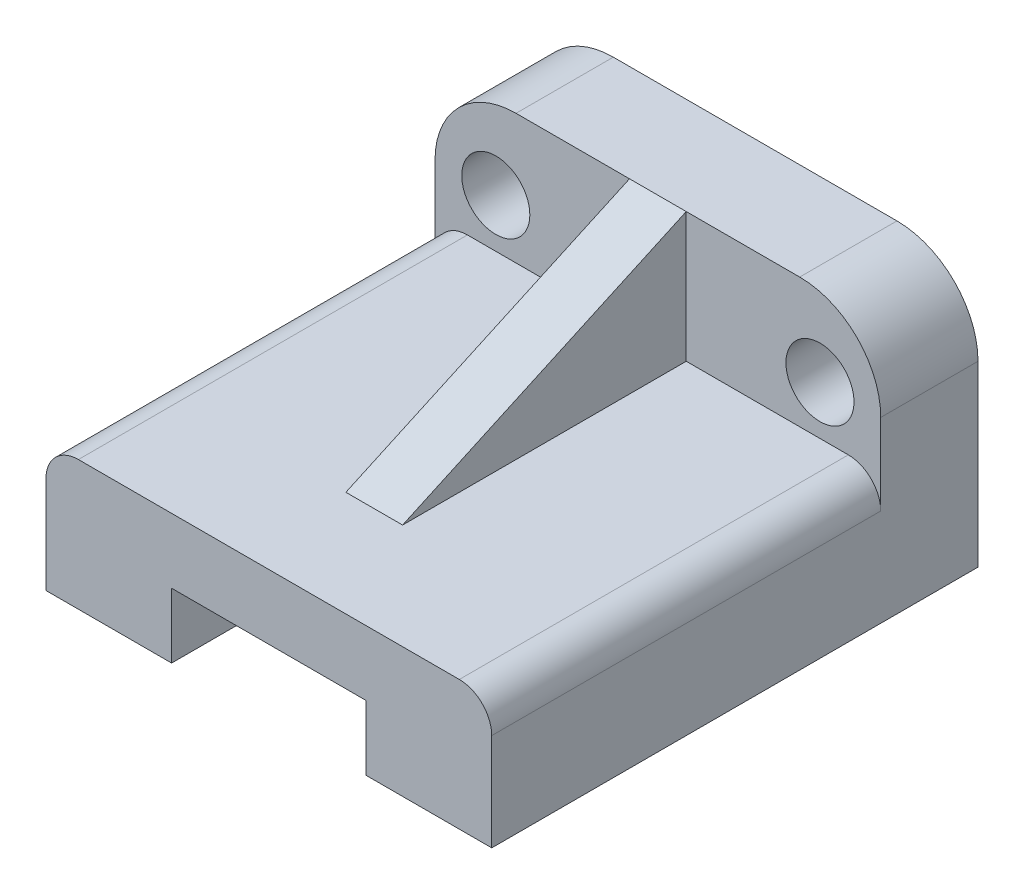
ISO-10303-21;
HEADER;
FILE_DESCRIPTION(('STEP AP214'),'2;1');
FILE_NAME('part.step','',(''),(''),'','','');
FILE_SCHEMA(('AUTOMOTIVE_DESIGN { 1 0 10303 214 1 1 1 1 }'));
ENDSEC;
DATA;
#1=APPLICATION_CONTEXT('core data for automotive mechanical design processes');
#2=APPLICATION_PROTOCOL_DEFINITION('international standard','automotive_design',2000,#1);
#3=PRODUCT_CONTEXT('',#1,'mechanical');
#4=PRODUCT('Part','Part','',(#3));
#5=PRODUCT_RELATED_PRODUCT_CATEGORY('part','',(#4));
#6=PRODUCT_DEFINITION_FORMATION('','',#4);
#7=PRODUCT_DEFINITION_CONTEXT('part definition',#1,'design');
#8=PRODUCT_DEFINITION('design','',#6,#7);
#9=PRODUCT_DEFINITION_SHAPE('','',#8);
#10=(LENGTH_UNIT() NAMED_UNIT(*) SI_UNIT(.MILLI.,.METRE.));
#11=(NAMED_UNIT(*) PLANE_ANGLE_UNIT() SI_UNIT($,.RADIAN.));
#12=(NAMED_UNIT(*) SI_UNIT($,.STERADIAN.) SOLID_ANGLE_UNIT());
#13=UNCERTAINTY_MEASURE_WITH_UNIT(LENGTH_MEASURE(1.E-05),#10,'distance_accuracy_value','');
#14=(GEOMETRIC_REPRESENTATION_CONTEXT(3) GLOBAL_UNCERTAINTY_ASSIGNED_CONTEXT((#13)) GLOBAL_UNIT_ASSIGNED_CONTEXT((#10,
#11,#12)) REPRESENTATION_CONTEXT('',''));
#15=CARTESIAN_POINT('',(0.,0.,0.));
#16=DIRECTION('',(0.,0.,1.));
#17=DIRECTION('',(1.,0.,0.));
#18=AXIS2_PLACEMENT_3D('',#15,#16,#17);
#19=CARTESIAN_POINT('',(-17.5,6.,12.));
#20=DIRECTION('',(0.,0.,1.));
#21=DIRECTION('',(1.,0.,0.));
#22=AXIS2_PLACEMENT_3D('',#19,#20,#21);
#23=PLANE('',#22);
#24=CARTESIAN_POINT('',(20.,6.,12.));
#25=DIRECTION('',(0.,0.,1.));
#26=DIRECTION('',(-1.,0.,0.));
#27=AXIS2_PLACEMENT_3D('',#24,#25,#26);
#28=CIRCLE('',#27,4.2);
#29=CARTESIAN_POINT('',(15.8,6.,12.));
#30=VERTEX_POINT('',#29);
#31=EDGE_CURVE('E283',#30,#30,#28,.T.);
#32=ORIENTED_EDGE('',*,*,#31,.F.);
#33=EDGE_LOOP('',(#32));
#34=FACE_BOUND('',#33,.T.);
#35=DIRECTION('',(-1.,0.,0.));
#36=VECTOR('',#35,1.);
#37=CARTESIAN_POINT('',(-17.4999999999999,16.,12.));
#38=LINE('',#37,#36);
#39=CARTESIAN_POINT('',(17.4999999999999,16.,12.));
#40=VERTEX_POINT('',#39);
#41=CARTESIAN_POINT('',(3.5,16.,12.));
#42=VERTEX_POINT('',#41);
#43=EDGE_CURVE('E178',#40,#42,#38,.T.);
#44=ORIENTED_EDGE('',*,*,#43,.T.);
#45=DIRECTION('',(0.,1.,0.));
#46=VECTOR('',#45,1.);
#47=CARTESIAN_POINT('',(3.5,0.,12.));
#48=LINE('',#47,#46);
#49=CARTESIAN_POINT('',(3.5,0.,12.));
#50=VERTEX_POINT('',#49);
#51=EDGE_CURVE('E164',#50,#42,#48,.T.);
#52=ORIENTED_EDGE('',*,*,#51,.F.);
#53=DIRECTION('',(-1.,0.,0.));
#54=VECTOR('',#53,1.);
#55=CARTESIAN_POINT('',(-23.5,0.,12.));
#56=LINE('',#55,#54);
#57=CARTESIAN_POINT('',(23.5,0.,12.));
#58=VERTEX_POINT('',#57);
#59=EDGE_CURVE('E253',#58,#50,#56,.T.);
#60=ORIENTED_EDGE('',*,*,#59,.F.);
#61=CARTESIAN_POINT('',(23.5,-4.,12.));
#62=DIRECTION('',(0.,0.,1.));
#63=DIRECTION('',(-1.,0.,0.));
#64=AXIS2_PLACEMENT_3D('',#61,#62,#63);
#65=CIRCLE('',#64,4.);
#66=CARTESIAN_POINT('',(27.5,-4.,12.));
#67=VERTEX_POINT('',#66);
#68=EDGE_CURVE('E294',#67,#58,#65,.T.);
#69=ORIENTED_EDGE('',*,*,#68,.F.);
#70=DIRECTION('',(0.,1.,0.));
#71=VECTOR('',#70,1.);
#72=CARTESIAN_POINT('',(27.5,5.99999999999993,12.));
#73=LINE('',#72,#71);
#74=CARTESIAN_POINT('',(27.5,5.99999999999993,12.));
#75=VERTEX_POINT('',#74);
#76=EDGE_CURVE('E211',#67,#75,#73,.T.);
#77=ORIENTED_EDGE('',*,*,#76,.T.);
#78=CARTESIAN_POINT('',(17.5,6.,12.));
#79=DIRECTION('',(0.,0.,1.));
#80=DIRECTION('',(-1.,0.,0.));
#81=AXIS2_PLACEMENT_3D('',#78,#79,#80);
#82=CIRCLE('',#81,10.);
#83=EDGE_CURVE('E184',#75,#40,#82,.T.);
#84=ORIENTED_EDGE('',*,*,#83,.T.);
#85=EDGE_LOOP('',(#44,#52,#60,#69,#77,#84));
#86=FACE_BOUND('',#85,.T.);
#87=ADVANCED_FACE('F33',(#34,#86),#23,.T.);
#88=CARTESIAN_POINT('',(-23.5,0.,60.));
#89=DIRECTION('',(0.,-1.,0.));
#90=DIRECTION('',(0.,0.,-1.));
#91=AXIS2_PLACEMENT_3D('',#88,#89,#90);
#92=PLANE('',#91);
#93=DIRECTION('',(0.,0.,-1.));
#94=VECTOR('',#93,1.);
#95=CARTESIAN_POINT('',(3.5,0.,47.));
#96=LINE('',#95,#94);
#97=CARTESIAN_POINT('',(3.5,0.,47.));
#98=VERTEX_POINT('',#97);
#99=EDGE_CURVE('E163',#98,#50,#96,.T.);
#100=ORIENTED_EDGE('',*,*,#99,.F.);
#101=DIRECTION('',(-1.,0.,0.));
#102=VECTOR('',#101,1.);
#103=CARTESIAN_POINT('',(3.5,0.,47.));
#104=LINE('',#103,#102);
#105=CARTESIAN_POINT('',(-3.5,0.,47.));
#106=VERTEX_POINT('',#105);
#107=EDGE_CURVE('E160',#98,#106,#104,.T.);
#108=ORIENTED_EDGE('',*,*,#107,.T.);
#109=DIRECTION('',(0.,0.,-1.));
#110=VECTOR('',#109,1.);
#111=CARTESIAN_POINT('',(-3.5,0.,47.));
#112=LINE('',#111,#110);
#113=CARTESIAN_POINT('',(-3.5,0.,12.));
#114=VERTEX_POINT('',#113);
#115=EDGE_CURVE('E171',#106,#114,#112,.T.);
#116=ORIENTED_EDGE('',*,*,#115,.T.);
#117=CARTESIAN_POINT('',(-23.5,0.,12.));
#118=VERTEX_POINT('',#117);
#119=EDGE_CURVE('E55',#114,#118,#56,.T.);
#120=ORIENTED_EDGE('',*,*,#119,.T.);
#121=DIRECTION('',(0.,0.,-1.));
#122=VECTOR('',#121,1.);
#123=CARTESIAN_POINT('',(-23.5,0.,60.));
#124=LINE('',#123,#122);
#125=CARTESIAN_POINT('',(-23.5,0.,60.));
#126=VERTEX_POINT('',#125);
#127=EDGE_CURVE('E251',#126,#118,#124,.T.);
#128=ORIENTED_EDGE('',*,*,#127,.F.);
#129=DIRECTION('',(-1.,0.,0.));
#130=VECTOR('',#129,1.);
#131=CARTESIAN_POINT('',(-23.5,0.,60.));
#132=LINE('',#131,#130);
#133=CARTESIAN_POINT('',(23.5,0.,60.));
#134=VERTEX_POINT('',#133);
#135=EDGE_CURVE('E309',#134,#126,#132,.T.);
#136=ORIENTED_EDGE('',*,*,#135,.F.);
#137=DIRECTION('',(0.,0.,-1.));
#138=VECTOR('',#137,1.);
#139=CARTESIAN_POINT('',(23.5,0.,60.));
#140=LINE('',#139,#138);
#141=EDGE_CURVE('E264',#134,#58,#140,.T.);
#142=ORIENTED_EDGE('',*,*,#141,.T.);
#143=ORIENTED_EDGE('',*,*,#59,.T.);
#144=EDGE_LOOP('',(#100,#108,#116,#120,#128,#136,#142,#143));
#145=FACE_BOUND('',#144,.T.);
#146=ADVANCED_FACE('F326',(#145),#92,.F.);
#147=DIRECTION('',(0.,1.,0.));
#148=VECTOR('',#147,1.);
#149=CARTESIAN_POINT('',(-3.5,0.,12.));
#150=LINE('',#149,#148);
#151=CARTESIAN_POINT('',(-3.5,16.,12.));
#152=VERTEX_POINT('',#151);
#153=EDGE_CURVE('E48',#114,#152,#150,.T.);
#154=ORIENTED_EDGE('',*,*,#153,.T.);
#155=CARTESIAN_POINT('',(-17.4999999999999,16.,12.));
#156=VERTEX_POINT('',#155);
#157=EDGE_CURVE('E180',#152,#156,#38,.T.);
#158=ORIENTED_EDGE('',*,*,#157,.T.);
#159=CARTESIAN_POINT('',(-17.5,6.,12.));
#160=DIRECTION('',(0.,0.,1.));
#161=DIRECTION('',(1.,0.,0.));
#162=AXIS2_PLACEMENT_3D('',#159,#160,#161);
#163=CIRCLE('',#162,10.);
#164=CARTESIAN_POINT('',(-27.5,5.99999999999993,12.));
#165=VERTEX_POINT('',#164);
#166=EDGE_CURVE('E186',#156,#165,#163,.T.);
#167=ORIENTED_EDGE('',*,*,#166,.T.);
#168=DIRECTION('',(0.,-1.,0.));
#169=VECTOR('',#168,1.);
#170=CARTESIAN_POINT('',(-27.5,5.99999999999993,12.));
#171=LINE('',#170,#169);
#172=CARTESIAN_POINT('',(-27.5,-4.,12.));
#173=VERTEX_POINT('',#172);
#174=EDGE_CURVE('E188',#165,#173,#171,.T.);
#175=ORIENTED_EDGE('',*,*,#174,.T.);
#176=CARTESIAN_POINT('',(-23.5,-4.,12.));
#177=DIRECTION('',(0.,0.,1.));
#178=DIRECTION('',(-1.,0.,0.));
#179=AXIS2_PLACEMENT_3D('',#176,#177,#178);
#180=CIRCLE('',#179,4.);
#181=EDGE_CURVE('E246',#118,#173,#180,.T.);
#182=ORIENTED_EDGE('',*,*,#181,.F.);
#183=ORIENTED_EDGE('',*,*,#119,.F.);
#184=EDGE_LOOP('',(#154,#158,#167,#175,#182,#183));
#185=FACE_BOUND('',#184,.T.);
#186=CARTESIAN_POINT('',(-20.,6.,12.));
#187=DIRECTION('',(0.,0.,1.));
#188=DIRECTION('',(1.,0.,0.));
#189=AXIS2_PLACEMENT_3D('',#186,#187,#188);
#190=CIRCLE('',#189,4.2);
#191=CARTESIAN_POINT('',(-15.8,6.,12.));
#192=VERTEX_POINT('',#191);
#193=EDGE_CURVE('E201',#192,#192,#190,.T.);
#194=ORIENTED_EDGE('',*,*,#193,.F.);
#195=EDGE_LOOP('',(#194));
#196=FACE_BOUND('',#195,.T.);
#197=ADVANCED_FACE('F244',(#185,#196),#23,.T.);
#198=DIRECTION('',(0.,-1.,0.));
#199=VECTOR('',#198,1.);
#200=CARTESIAN_POINT('',(12.,-16.,12.));
#201=LINE('',#200,#199);
#202=CARTESIAN_POINT('',(12.,-8.,12.));
#203=VERTEX_POINT('',#202);
#204=CARTESIAN_POINT('',(12.,-16.,12.));
#205=VERTEX_POINT('',#204);
#206=EDGE_CURVE('E320',#203,#205,#201,.T.);
#207=ORIENTED_EDGE('',*,*,#206,.F.);
#208=DIRECTION('',(1.,0.,0.));
#209=VECTOR('',#208,1.);
#210=CARTESIAN_POINT('',(-12.,-8.,12.));
#211=LINE('',#210,#209);
#212=CARTESIAN_POINT('',(-12.,-8.,12.));
#213=VERTEX_POINT('',#212);
#214=EDGE_CURVE('E317',#213,#203,#211,.T.);
#215=ORIENTED_EDGE('',*,*,#214,.F.);
#216=DIRECTION('',(0.,1.,0.));
#217=VECTOR('',#216,1.);
#218=CARTESIAN_POINT('',(-12.,-16.,12.));
#219=LINE('',#218,#217);
#220=CARTESIAN_POINT('',(-12.,-16.,12.));
#221=VERTEX_POINT('',#220);
#222=EDGE_CURVE('E181',#221,#213,#219,.T.);
#223=ORIENTED_EDGE('',*,*,#222,.F.);
#224=DIRECTION('',(1.,0.,0.));
#225=VECTOR('',#224,1.);
#226=CARTESIAN_POINT('',(-27.5,-16.,12.));
#227=LINE('',#226,#225);
#228=EDGE_CURVE('E194',#221,#205,#227,.T.);
#229=ORIENTED_EDGE('',*,*,#228,.T.);
#230=EDGE_LOOP('',(#207,#215,#223,#229));
#231=FACE_BOUND('',#230,.T.);
#232=ADVANCED_FACE('F351',(#231),#23,.T.);
#233=CARTESIAN_POINT('',(-17.5,6.,0.));
#234=DIRECTION('',(0.,0.,1.));
#235=DIRECTION('',(1.,0.,0.));
#236=AXIS2_PLACEMENT_3D('',#233,#234,#235);
#237=PLANE('',#236);
#238=DIRECTION('',(0.,1.,0.));
#239=VECTOR('',#238,1.);
#240=CARTESIAN_POINT('',(27.5,5.99999999999993,0.));
#241=LINE('',#240,#239);
#242=CARTESIAN_POINT('',(27.5,-16.,0.));
#243=VERTEX_POINT('',#242);
#244=CARTESIAN_POINT('',(27.5,5.99999999999993,0.));
#245=VERTEX_POINT('',#244);
#246=EDGE_CURVE('E197',#243,#245,#241,.T.);
#247=ORIENTED_EDGE('',*,*,#246,.F.);
#248=DIRECTION('',(1.,0.,0.));
#249=VECTOR('',#248,1.);
#250=CARTESIAN_POINT('',(-27.5,-16.,0.));
#251=LINE('',#250,#249);
#252=CARTESIAN_POINT('',(-27.5,-16.,0.));
#253=VERTEX_POINT('',#252);
#254=EDGE_CURVE('E209',#253,#243,#251,.T.);
#255=ORIENTED_EDGE('',*,*,#254,.F.);
#256=DIRECTION('',(0.,-1.,0.));
#257=VECTOR('',#256,1.);
#258=CARTESIAN_POINT('',(-27.5,5.99999999999993,0.));
#259=LINE('',#258,#257);
#260=CARTESIAN_POINT('',(-27.5,5.99999999999993,0.));
#261=VERTEX_POINT('',#260);
#262=EDGE_CURVE('E207',#261,#253,#259,.T.);
#263=ORIENTED_EDGE('',*,*,#262,.F.);
#264=CARTESIAN_POINT('',(-17.5,6.,0.));
#265=DIRECTION('',(0.,0.,1.));
#266=DIRECTION('',(1.,0.,0.));
#267=AXIS2_PLACEMENT_3D('',#264,#265,#266);
#268=CIRCLE('',#267,10.);
#269=CARTESIAN_POINT('',(-17.4999999999999,16.,0.));
#270=VERTEX_POINT('',#269);
#271=EDGE_CURVE('E205',#270,#261,#268,.T.);
#272=ORIENTED_EDGE('',*,*,#271,.F.);
#273=DIRECTION('',(-1.,0.,0.));
#274=VECTOR('',#273,1.);
#275=CARTESIAN_POINT('',(-17.4999999999999,16.,0.));
#276=LINE('',#275,#274);
#277=CARTESIAN_POINT('',(17.4999999999999,16.,0.));
#278=VERTEX_POINT('',#277);
#279=EDGE_CURVE('E203',#278,#270,#276,.T.);
#280=ORIENTED_EDGE('',*,*,#279,.F.);
#281=CARTESIAN_POINT('',(17.5,6.,0.));
#282=DIRECTION('',(0.,0.,1.));
#283=DIRECTION('',(-1.,0.,0.));
#284=AXIS2_PLACEMENT_3D('',#281,#282,#283);
#285=CIRCLE('',#284,10.);
#286=EDGE_CURVE('E200',#245,#278,#285,.T.);
#287=ORIENTED_EDGE('',*,*,#286,.F.);
#288=EDGE_LOOP('',(#247,#255,#263,#272,#280,#287));
#289=FACE_BOUND('',#288,.T.);
#290=CARTESIAN_POINT('',(-20.,6.,0.));
#291=DIRECTION('',(0.,0.,1.));
#292=DIRECTION('',(1.,0.,0.));
#293=AXIS2_PLACEMENT_3D('',#290,#291,#292);
#294=CIRCLE('',#293,4.2);
#295=CARTESIAN_POINT('',(-15.8,6.,0.));
#296=VERTEX_POINT('',#295);
#297=EDGE_CURVE('E286',#296,#296,#294,.T.);
#298=ORIENTED_EDGE('',*,*,#297,.T.);
#299=EDGE_LOOP('',(#298));
#300=FACE_BOUND('',#299,.T.);
#301=CARTESIAN_POINT('',(20.,6.,0.));
#302=DIRECTION('',(0.,0.,1.));
#303=DIRECTION('',(-1.,0.,0.));
#304=AXIS2_PLACEMENT_3D('',#301,#302,#303);
#305=CIRCLE('',#304,4.2);
#306=CARTESIAN_POINT('',(15.8,6.,0.));
#307=VERTEX_POINT('',#306);
#308=EDGE_CURVE('E282',#307,#307,#305,.T.);
#309=ORIENTED_EDGE('',*,*,#308,.T.);
#310=EDGE_LOOP('',(#309));
#311=FACE_BOUND('',#310,.T.);
#312=ADVANCED_FACE('F227',(#289,#300,#311),#237,.F.);
#313=CARTESIAN_POINT('',(27.5,5.99999999999993,12.));
#314=DIRECTION('',(-1.,0.,0.));
#315=DIRECTION('',(0.,0.,1.));
#316=AXIS2_PLACEMENT_3D('',#313,#314,#315);
#317=PLANE('',#316);
#318=ORIENTED_EDGE('',*,*,#246,.T.);
#319=DIRECTION('',(0.,0.,-1.));
#320=VECTOR('',#319,1.);
#321=CARTESIAN_POINT('',(27.5,5.99999999999993,12.));
#322=LINE('',#321,#320);
#323=EDGE_CURVE('E11',#75,#245,#322,.T.);
#324=ORIENTED_EDGE('',*,*,#323,.F.);
#325=ORIENTED_EDGE('',*,*,#76,.F.);
#326=DIRECTION('',(0.,0.,-1.));
#327=VECTOR('',#326,1.);
#328=CARTESIAN_POINT('',(27.5,-4.00000000000003,60.));
#329=LINE('',#328,#327);
#330=CARTESIAN_POINT('',(27.5,-4.00000000000003,60.));
#331=VERTEX_POINT('',#330);
#332=EDGE_CURVE('E267',#331,#67,#329,.T.);
#333=ORIENTED_EDGE('',*,*,#332,.F.);
#334=DIRECTION('',(0.,1.,0.));
#335=VECTOR('',#334,1.);
#336=CARTESIAN_POINT('',(27.5,-16.,60.));
#337=LINE('',#336,#335);
#338=CARTESIAN_POINT('',(27.5,-16.,60.));
#339=VERTEX_POINT('',#338);
#340=EDGE_CURVE('E343',#339,#331,#337,.T.);
#341=ORIENTED_EDGE('',*,*,#340,.F.);
#342=DIRECTION('',(0.,0.,-1.));
#343=VECTOR('',#342,1.);
#344=CARTESIAN_POINT('',(27.5,-16.,12.));
#345=LINE('',#344,#343);
#346=EDGE_CURVE('E196',#339,#243,#345,.T.);
#347=ORIENTED_EDGE('',*,*,#346,.T.);
#348=EDGE_LOOP('',(#318,#324,#325,#333,#341,#347));
#349=FACE_BOUND('',#348,.T.);
#350=ADVANCED_FACE('F35',(#349),#317,.F.);
#351=CARTESIAN_POINT('',(17.5,6.,12.));
#352=DIRECTION('',(0.,0.,-1.));
#353=DIRECTION('',(-1.,0.,0.));
#354=AXIS2_PLACEMENT_3D('',#351,#352,#353);
#355=CYLINDRICAL_SURFACE('',#354,10.);
#356=ORIENTED_EDGE('',*,*,#286,.T.);
#357=DIRECTION('',(0.,0.,-1.));
#358=VECTOR('',#357,1.);
#359=CARTESIAN_POINT('',(17.4999999999999,16.,12.));
#360=LINE('',#359,#358);
#361=EDGE_CURVE('E41',#40,#278,#360,.T.);
#362=ORIENTED_EDGE('',*,*,#361,.F.);
#363=ORIENTED_EDGE('',*,*,#83,.F.);
#364=ORIENTED_EDGE('',*,*,#323,.T.);
#365=EDGE_LOOP('',(#356,#362,#363,#364));
#366=FACE_BOUND('',#365,.T.);
#367=ADVANCED_FACE('F298',(#366),#355,.T.);
#368=CARTESIAN_POINT('',(-17.4999999999999,16.,12.));
#369=DIRECTION('',(0.,-1.,0.));
#370=DIRECTION('',(0.,0.,-1.));
#371=AXIS2_PLACEMENT_3D('',#368,#369,#370);
#372=PLANE('',#371);
#373=ORIENTED_EDGE('',*,*,#279,.T.);
#374=DIRECTION('',(0.,0.,-1.));
#375=VECTOR('',#374,1.);
#376=CARTESIAN_POINT('',(-17.4999999999999,16.,12.));
#377=LINE('',#376,#375);
#378=EDGE_CURVE('E220',#156,#270,#377,.T.);
#379=ORIENTED_EDGE('',*,*,#378,.F.);
#380=ORIENTED_EDGE('',*,*,#157,.F.);
#381=DIRECTION('',(-1.,0.,0.));
#382=VECTOR('',#381,1.);
#383=CARTESIAN_POINT('',(3.5,16.,12.));
#384=LINE('',#383,#382);
#385=EDGE_CURVE('E158',#42,#152,#384,.T.);
#386=ORIENTED_EDGE('',*,*,#385,.F.);
#387=ORIENTED_EDGE('',*,*,#43,.F.);
#388=ORIENTED_EDGE('',*,*,#361,.T.);
#389=EDGE_LOOP('',(#373,#379,#380,#386,#387,#388));
#390=FACE_BOUND('',#389,.T.);
#391=ADVANCED_FACE('F176',(#390),#372,.F.);
#392=CARTESIAN_POINT('',(-17.5,6.,12.));
#393=DIRECTION('',(0.,0.,-1.));
#394=DIRECTION('',(-1.,0.,0.));
#395=AXIS2_PLACEMENT_3D('',#392,#393,#394);
#396=CYLINDRICAL_SURFACE('',#395,10.);
#397=ORIENTED_EDGE('',*,*,#271,.T.);
#398=DIRECTION('',(0.,0.,-1.));
#399=VECTOR('',#398,1.);
#400=CARTESIAN_POINT('',(-27.5,5.99999999999993,12.));
#401=LINE('',#400,#399);
#402=EDGE_CURVE('E217',#165,#261,#401,.T.);
#403=ORIENTED_EDGE('',*,*,#402,.F.);
#404=ORIENTED_EDGE('',*,*,#166,.F.);
#405=ORIENTED_EDGE('',*,*,#378,.T.);
#406=EDGE_LOOP('',(#397,#403,#404,#405));
#407=FACE_BOUND('',#406,.T.);
#408=ADVANCED_FACE('F233',(#407),#396,.T.);
#409=CARTESIAN_POINT('',(-27.5,5.99999999999993,12.));
#410=DIRECTION('',(1.,0.,0.));
#411=DIRECTION('',(0.,1.,0.));
#412=AXIS2_PLACEMENT_3D('',#409,#410,#411);
#413=PLANE('',#412);
#414=ORIENTED_EDGE('',*,*,#262,.T.);
#415=DIRECTION('',(0.,0.,-1.));
#416=VECTOR('',#415,1.);
#417=CARTESIAN_POINT('',(-27.5,-16.,12.));
#418=LINE('',#417,#416);
#419=CARTESIAN_POINT('',(-27.5,-16.,60.));
#420=VERTEX_POINT('',#419);
#421=EDGE_CURVE('E214',#420,#253,#418,.T.);
#422=ORIENTED_EDGE('',*,*,#421,.F.);
#423=DIRECTION('',(0.,-1.,0.));
#424=VECTOR('',#423,1.);
#425=CARTESIAN_POINT('',(-27.5,-16.,60.));
#426=LINE('',#425,#424);
#427=CARTESIAN_POINT('',(-27.5,-4.00000000000003,60.));
#428=VERTEX_POINT('',#427);
#429=EDGE_CURVE('E252',#428,#420,#426,.T.);
#430=ORIENTED_EDGE('',*,*,#429,.F.);
#431=DIRECTION('',(0.,0.,-1.));
#432=VECTOR('',#431,1.);
#433=CARTESIAN_POINT('',(-27.5,-4.00000000000003,60.));
#434=LINE('',#433,#432);
#435=EDGE_CURVE('E241',#428,#173,#434,.T.);
#436=ORIENTED_EDGE('',*,*,#435,.T.);
#437=ORIENTED_EDGE('',*,*,#174,.F.);
#438=ORIENTED_EDGE('',*,*,#402,.T.);
#439=EDGE_LOOP('',(#414,#422,#430,#436,#437,#438));
#440=FACE_BOUND('',#439,.T.);
#441=ADVANCED_FACE('F237',(#440),#413,.F.);
#442=CARTESIAN_POINT('',(-27.5,-16.,12.));
#443=DIRECTION('',(0.,1.,0.));
#444=DIRECTION('',(0.,0.,1.));
#445=AXIS2_PLACEMENT_3D('',#442,#443,#444);
#446=PLANE('',#445);
#447=ORIENTED_EDGE('',*,*,#254,.T.);
#448=ORIENTED_EDGE('',*,*,#346,.F.);
#449=DIRECTION('',(1.,0.,0.));
#450=VECTOR('',#449,1.);
#451=CARTESIAN_POINT('',(12.,-16.,60.));
#452=LINE('',#451,#450);
#453=CARTESIAN_POINT('',(12.,-16.,60.));
#454=VERTEX_POINT('',#453);
#455=EDGE_CURVE('E341',#454,#339,#452,.T.);
#456=ORIENTED_EDGE('',*,*,#455,.F.);
#457=DIRECTION('',(0.,0.,-1.));
#458=VECTOR('',#457,1.);
#459=CARTESIAN_POINT('',(12.,-16.,60.));
#460=LINE('',#459,#458);
#461=EDGE_CURVE('E270',#454,#205,#460,.T.);
#462=ORIENTED_EDGE('',*,*,#461,.T.);
#463=ORIENTED_EDGE('',*,*,#228,.F.);
#464=DIRECTION('',(0.,0.,-1.));
#465=VECTOR('',#464,1.);
#466=CARTESIAN_POINT('',(-12.,-16.,60.));
#467=LINE('',#466,#465);
#468=CARTESIAN_POINT('',(-12.,-16.,60.));
#469=VERTEX_POINT('',#468);
#470=EDGE_CURVE('E279',#469,#221,#467,.T.);
#471=ORIENTED_EDGE('',*,*,#470,.F.);
#472=DIRECTION('',(1.,0.,0.));
#473=VECTOR('',#472,1.);
#474=CARTESIAN_POINT('',(-27.5,-16.,60.));
#475=LINE('',#474,#473);
#476=EDGE_CURVE('E256',#420,#469,#475,.T.);
#477=ORIENTED_EDGE('',*,*,#476,.F.);
#478=ORIENTED_EDGE('',*,*,#421,.T.);
#479=EDGE_LOOP('',(#447,#448,#456,#462,#463,#471,#477,#478));
#480=FACE_BOUND('',#479,.T.);
#481=ADVANCED_FACE('F301',(#480),#446,.F.);
#482=CARTESIAN_POINT('',(-20.,6.,12.));
#483=DIRECTION('',(0.,0.,-1.));
#484=DIRECTION('',(-1.,0.,0.));
#485=AXIS2_PLACEMENT_3D('',#482,#483,#484);
#486=CYLINDRICAL_SURFACE('',#485,4.2);
#487=ORIENTED_EDGE('',*,*,#193,.T.);
#488=EDGE_LOOP('',(#487));
#489=FACE_BOUND('',#488,.T.);
#490=ORIENTED_EDGE('',*,*,#297,.F.);
#491=EDGE_LOOP('',(#490));
#492=FACE_BOUND('',#491,.T.);
#493=ADVANCED_FACE('F367',(#489,#492),#486,.F.);
#494=CARTESIAN_POINT('',(20.,6.,12.));
#495=DIRECTION('',(0.,0.,-1.));
#496=DIRECTION('',(-1.,0.,0.));
#497=AXIS2_PLACEMENT_3D('',#494,#495,#496);
#498=CYLINDRICAL_SURFACE('',#497,4.2);
#499=ORIENTED_EDGE('',*,*,#31,.T.);
#500=EDGE_LOOP('',(#499));
#501=FACE_BOUND('',#500,.T.);
#502=ORIENTED_EDGE('',*,*,#308,.F.);
#503=EDGE_LOOP('',(#502));
#504=FACE_BOUND('',#503,.T.);
#505=ADVANCED_FACE('F360',(#501,#504),#498,.F.);
#506=CARTESIAN_POINT('',(-12.,-16.,60.));
#507=DIRECTION('',(-1.,0.,0.));
#508=DIRECTION('',(0.,-1.,0.));
#509=AXIS2_PLACEMENT_3D('',#506,#507,#508);
#510=PLANE('',#509);
#511=ORIENTED_EDGE('',*,*,#222,.T.);
#512=DIRECTION('',(0.,0.,-1.));
#513=VECTOR('',#512,1.);
#514=CARTESIAN_POINT('',(-12.,-8.,60.));
#515=LINE('',#514,#513);
#516=CARTESIAN_POINT('',(-12.,-8.,60.));
#517=VERTEX_POINT('',#516);
#518=EDGE_CURVE('E276',#517,#213,#515,.T.);
#519=ORIENTED_EDGE('',*,*,#518,.F.);
#520=DIRECTION('',(0.,1.,0.));
#521=VECTOR('',#520,1.);
#522=CARTESIAN_POINT('',(-12.,-16.,60.));
#523=LINE('',#522,#521);
#524=EDGE_CURVE('E335',#469,#517,#523,.T.);
#525=ORIENTED_EDGE('',*,*,#524,.F.);
#526=ORIENTED_EDGE('',*,*,#470,.T.);
#527=EDGE_LOOP('',(#511,#519,#525,#526));
#528=FACE_BOUND('',#527,.T.);
#529=ADVANCED_FACE('F358',(#528),#510,.F.);
#530=CARTESIAN_POINT('',(-12.,-8.,60.));
#531=DIRECTION('',(0.,1.,0.));
#532=DIRECTION('',(0.,0.,1.));
#533=AXIS2_PLACEMENT_3D('',#530,#531,#532);
#534=PLANE('',#533);
#535=ORIENTED_EDGE('',*,*,#214,.T.);
#536=DIRECTION('',(0.,0.,-1.));
#537=VECTOR('',#536,1.);
#538=CARTESIAN_POINT('',(12.,-8.,60.));
#539=LINE('',#538,#537);
#540=CARTESIAN_POINT('',(12.,-8.,60.));
#541=VERTEX_POINT('',#540);
#542=EDGE_CURVE('E273',#541,#203,#539,.T.);
#543=ORIENTED_EDGE('',*,*,#542,.F.);
#544=DIRECTION('',(1.,0.,0.));
#545=VECTOR('',#544,1.);
#546=CARTESIAN_POINT('',(-12.,-8.,60.));
#547=LINE('',#546,#545);
#548=EDGE_CURVE('E337',#517,#541,#547,.T.);
#549=ORIENTED_EDGE('',*,*,#548,.F.);
#550=ORIENTED_EDGE('',*,*,#518,.T.);
#551=EDGE_LOOP('',(#535,#543,#549,#550));
#552=FACE_BOUND('',#551,.T.);
#553=ADVANCED_FACE('F353',(#552),#534,.F.);
#554=CARTESIAN_POINT('',(12.,-16.,60.));
#555=DIRECTION('',(1.,0.,0.));
#556=DIRECTION('',(0.,1.,0.));
#557=AXIS2_PLACEMENT_3D('',#554,#555,#556);
#558=PLANE('',#557);
#559=ORIENTED_EDGE('',*,*,#206,.T.);
#560=ORIENTED_EDGE('',*,*,#461,.F.);
#561=DIRECTION('',(0.,-1.,0.));
#562=VECTOR('',#561,1.);
#563=CARTESIAN_POINT('',(12.,-16.,60.));
#564=LINE('',#563,#562);
#565=EDGE_CURVE('E339',#541,#454,#564,.T.);
#566=ORIENTED_EDGE('',*,*,#565,.F.);
#567=ORIENTED_EDGE('',*,*,#542,.T.);
#568=EDGE_LOOP('',(#559,#560,#566,#567));
#569=FACE_BOUND('',#568,.T.);
#570=ADVANCED_FACE('F348',(#569),#558,.F.);
#571=CARTESIAN_POINT('',(23.5,-4.,60.));
#572=DIRECTION('',(0.,0.,-1.));
#573=DIRECTION('',(-1.,0.,0.));
#574=AXIS2_PLACEMENT_3D('',#571,#572,#573);
#575=CYLINDRICAL_SURFACE('',#574,4.);
#576=ORIENTED_EDGE('',*,*,#68,.T.);
#577=ORIENTED_EDGE('',*,*,#141,.F.);
#578=CARTESIAN_POINT('',(23.5,-4.,60.));
#579=DIRECTION('',(0.,0.,1.));
#580=DIRECTION('',(-1.,0.,0.));
#581=AXIS2_PLACEMENT_3D('',#578,#579,#580);
#582=CIRCLE('',#581,4.);
#583=EDGE_CURVE('E311',#331,#134,#582,.T.);
#584=ORIENTED_EDGE('',*,*,#583,.F.);
#585=ORIENTED_EDGE('',*,*,#332,.T.);
#586=EDGE_LOOP('',(#576,#577,#584,#585));
#587=FACE_BOUND('',#586,.T.);
#588=ADVANCED_FACE('F324',(#587),#575,.T.);
#589=CARTESIAN_POINT('',(-23.5,-4.,60.));
#590=DIRECTION('',(0.,0.,-1.));
#591=DIRECTION('',(-1.,0.,0.));
#592=AXIS2_PLACEMENT_3D('',#589,#590,#591);
#593=CYLINDRICAL_SURFACE('',#592,4.);
#594=ORIENTED_EDGE('',*,*,#181,.T.);
#595=ORIENTED_EDGE('',*,*,#435,.F.);
#596=CARTESIAN_POINT('',(-23.5,-4.,60.));
#597=DIRECTION('',(0.,0.,1.));
#598=DIRECTION('',(-1.,0.,0.));
#599=AXIS2_PLACEMENT_3D('',#596,#597,#598);
#600=CIRCLE('',#599,4.);
#601=EDGE_CURVE('E262',#126,#428,#600,.T.);
#602=ORIENTED_EDGE('',*,*,#601,.F.);
#603=ORIENTED_EDGE('',*,*,#127,.T.);
#604=EDGE_LOOP('',(#594,#595,#602,#603));
#605=FACE_BOUND('',#604,.T.);
#606=ADVANCED_FACE('F249',(#605),#593,.T.);
#607=CARTESIAN_POINT('',(-23.5,-4.,60.));
#608=DIRECTION('',(0.,0.,-1.));
#609=DIRECTION('',(-1.,0.,0.));
#610=AXIS2_PLACEMENT_3D('',#607,#608,#609);
#611=PLANE('',#610);
#612=ORIENTED_EDGE('',*,*,#429,.T.);
#613=ORIENTED_EDGE('',*,*,#476,.T.);
#614=ORIENTED_EDGE('',*,*,#524,.T.);
#615=ORIENTED_EDGE('',*,*,#548,.T.);
#616=ORIENTED_EDGE('',*,*,#565,.T.);
#617=ORIENTED_EDGE('',*,*,#455,.T.);
#618=ORIENTED_EDGE('',*,*,#340,.T.);
#619=ORIENTED_EDGE('',*,*,#583,.T.);
#620=ORIENTED_EDGE('',*,*,#135,.T.);
#621=ORIENTED_EDGE('',*,*,#601,.T.);
#622=EDGE_LOOP('',(#612,#613,#614,#615,#616,#617,#618,#619,#620,#621));
#623=FACE_BOUND('',#622,.T.);
#624=ADVANCED_FACE('F307',(#623),#611,.F.);
#625=CARTESIAN_POINT('',(3.5,16.,12.));
#626=DIRECTION('',(0.,-0.9094744755858,-0.415759760267794));
#627=DIRECTION('',(0.,0.415759760267794,-0.9094744755858));
#628=AXIS2_PLACEMENT_3D('',#625,#626,#627);
#629=PLANE('',#628);
#630=DIRECTION('',(0.,-0.415759760267794,0.9094744755858));
#631=VECTOR('',#630,1.);
#632=CARTESIAN_POINT('',(-3.5,16.,12.));
#633=LINE('',#632,#631);
#634=EDGE_CURVE('E331',#152,#106,#633,.T.);
#635=ORIENTED_EDGE('',*,*,#634,.T.);
#636=ORIENTED_EDGE('',*,*,#107,.F.);
#637=DIRECTION('',(0.,-0.415759760267794,0.9094744755858));
#638=VECTOR('',#637,1.);
#639=CARTESIAN_POINT('',(3.5,16.,12.));
#640=LINE('',#639,#638);
#641=EDGE_CURVE('E154',#42,#98,#640,.T.);
#642=ORIENTED_EDGE('',*,*,#641,.F.);
#643=ORIENTED_EDGE('',*,*,#385,.T.);
#644=EDGE_LOOP('',(#635,#636,#642,#643));
#645=FACE_BOUND('',#644,.T.);
#646=ADVANCED_FACE('F156',(#645),#629,.F.);
#647=CARTESIAN_POINT('',(3.5,0.,0.));
#648=DIRECTION('',(-1.,0.,0.));
#649=DIRECTION('',(0.,0.,1.));
#650=AXIS2_PLACEMENT_3D('',#647,#648,#649);
#651=PLANE('',#650);
#652=ORIENTED_EDGE('',*,*,#51,.T.);
#653=ORIENTED_EDGE('',*,*,#641,.T.);
#654=ORIENTED_EDGE('',*,*,#99,.T.);
#655=EDGE_LOOP('',(#652,#653,#654));
#656=FACE_BOUND('',#655,.T.);
#657=ADVANCED_FACE('F167',(#656),#651,.F.);
#658=CARTESIAN_POINT('',(-3.5,0.,0.));
#659=DIRECTION('',(-1.,0.,0.));
#660=DIRECTION('',(0.,0.,1.));
#661=AXIS2_PLACEMENT_3D('',#658,#659,#660);
#662=PLANE('',#661);
#663=ORIENTED_EDGE('',*,*,#153,.F.);
#664=ORIENTED_EDGE('',*,*,#115,.F.);
#665=ORIENTED_EDGE('',*,*,#634,.F.);
#666=EDGE_LOOP('',(#663,#664,#665));
#667=FACE_BOUND('',#666,.T.);
#668=ADVANCED_FACE('F519',(#667),#662,.T.);
#669=CLOSED_SHELL('',(#87,#146,#197,#232,#312,#350,#367,#391,#408,#441,#481,#493,#505,#529,#553,
#570,#588,#606,#624,#646,#657,#668));
#670=MANIFOLD_SOLID_BREP('B2',#669);
#671=ADVANCED_BREP_SHAPE_REPRESENTATION('',(#18,#670),#14);
#672=SHAPE_DEFINITION_REPRESENTATION(#9,#671);
ENDSEC;
END-ISO-10303-21;
